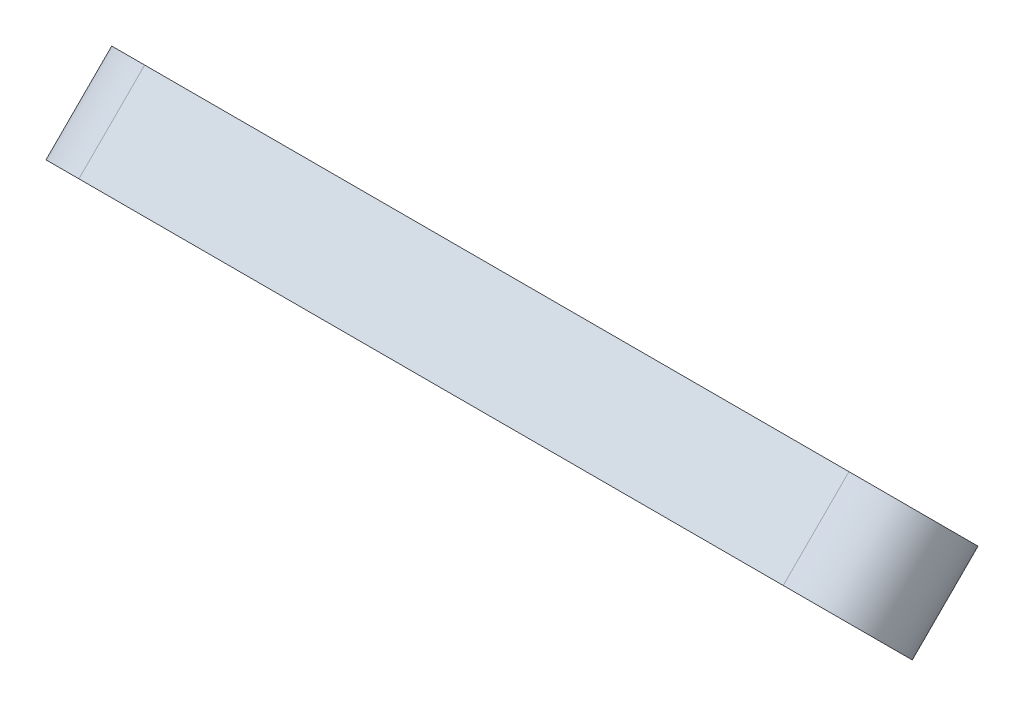
ISO-10303-21;
HEADER;
FILE_DESCRIPTION(('STEP AP214'),'2;1');
FILE_NAME('part.step','',(''),(''),'','','');
FILE_SCHEMA(('AUTOMOTIVE_DESIGN { 1 0 10303 214 1 1 1 1 }'));
ENDSEC;
DATA;
#1=APPLICATION_CONTEXT('core data for automotive mechanical design processes');
#2=APPLICATION_PROTOCOL_DEFINITION('international standard','automotive_design',2000,#1);
#3=PRODUCT_CONTEXT('',#1,'mechanical');
#4=PRODUCT('Part','Part','',(#3));
#5=PRODUCT_RELATED_PRODUCT_CATEGORY('part','',(#4));
#6=PRODUCT_DEFINITION_FORMATION('','',#4);
#7=PRODUCT_DEFINITION_CONTEXT('part definition',#1,'design');
#8=PRODUCT_DEFINITION('design','',#6,#7);
#9=PRODUCT_DEFINITION_SHAPE('','',#8);
#10=(LENGTH_UNIT() NAMED_UNIT(*) SI_UNIT(.MILLI.,.METRE.));
#11=(NAMED_UNIT(*) PLANE_ANGLE_UNIT() SI_UNIT($,.RADIAN.));
#12=(NAMED_UNIT(*) SI_UNIT($,.STERADIAN.) SOLID_ANGLE_UNIT());
#13=UNCERTAINTY_MEASURE_WITH_UNIT(LENGTH_MEASURE(1.E-05),#10,'distance_accuracy_value','');
#14=(GEOMETRIC_REPRESENTATION_CONTEXT(3) GLOBAL_UNCERTAINTY_ASSIGNED_CONTEXT((#13)) GLOBAL_UNIT_ASSIGNED_CONTEXT((#10,
#11,#12)) REPRESENTATION_CONTEXT('',''));
#15=CARTESIAN_POINT('',(0.,0.,0.));
#16=DIRECTION('',(0.,0.,1.));
#17=DIRECTION('',(1.,0.,0.));
#18=AXIS2_PLACEMENT_3D('',#15,#16,#17);
#19=CARTESIAN_POINT('',(134.383610490779,407.620315845602,313.814874477006));
#20=DIRECTION('',(0.,0.707106781186543,-0.707106781186552));
#21=DIRECTION('',(0.,0.707106781186552,0.707106781186543));
#22=AXIS2_PLACEMENT_3D('',#19,#20,#21);
#23=PLANE('',#22);
#24=CARTESIAN_POINT('',(60.190210490781,406.5986662742,312.793224905606));
#25=DIRECTION('',(0.,0.707106781186543,-0.707106781186552));
#26=DIRECTION('',(0.,0.707106781186552,0.707106781186543));
#27=AXIS2_PLACEMENT_3D('',#24,#25,#26);
#28=CIRCLE('',#27,2.28600000000289);
#29=CARTESIAN_POINT('',(60.190210490781,408.215112375994,314.4096710074));
#30=VERTEX_POINT('',#29);
#31=EDGE_CURVE('E121',#30,#30,#28,.T.);
#32=ORIENTED_EDGE('',*,*,#31,.F.);
#33=EDGE_LOOP('',(#32));
#34=FACE_BOUND('',#33,.T.);
#35=CARTESIAN_POINT('',(134.383610490779,407.620315845602,313.814874477006));
#36=DIRECTION('',(0.,0.707106781186543,-0.707106781186552));
#37=DIRECTION('',(0.,0.707106781186552,0.707106781186543));
#38=AXIS2_PLACEMENT_3D('',#35,#36,#37);
#39=CIRCLE('',#38,2.31139999999997);
#40=CARTESIAN_POINT('',(134.383610490779,409.254722459636,315.449281091041));
#41=VERTEX_POINT('',#40);
#42=EDGE_CURVE('E100',#41,#41,#39,.T.);
#43=ORIENTED_EDGE('',*,*,#42,.F.);
#44=EDGE_LOOP('',(#43));
#45=FACE_BOUND('',#44,.T.);
#46=CARTESIAN_POINT('',(134.383610490779,407.620315845602,313.814874477006));
#47=DIRECTION('',(0.,0.707106781186543,-0.707106781186552));
#48=DIRECTION('',(0.,0.707106781186552,0.707106781186543));
#49=AXIS2_PLACEMENT_3D('',#46,#47,#48);
#50=CIRCLE('',#49,9.03858422890067);
#51=CARTESIAN_POINT('',(134.207627879496,414.010348513103,320.204907144507));
#52=VERTEX_POINT('',#51);
#53=CARTESIAN_POINT('',(134.559593102062,401.230283178101,307.424841809505));
#54=VERTEX_POINT('',#53);
#55=EDGE_CURVE('E85',#52,#54,#50,.T.);
#56=ORIENTED_EDGE('',*,*,#55,.T.);
#57=DIRECTION('',(-0.999810438618444,-0.0137674767040955,-0.0137674767040756));
#58=VECTOR('',#57,1.);
#59=CARTESIAN_POINT('',(134.559593102062,401.230283178101,307.424841809505));
#60=LINE('',#59,#58);
#61=CARTESIAN_POINT('',(36.9727931020665,399.886504453923,306.081063085329));
#62=VERTEX_POINT('',#61);
#63=EDGE_CURVE('E80',#54,#62,#60,.T.);
#64=ORIENTED_EDGE('',*,*,#63,.T.);
#65=CARTESIAN_POINT('',(36.7968104907783,406.276537121425,312.471095752831));
#66=DIRECTION('',(0.,0.707106781186543,-0.707106781186552));
#67=DIRECTION('',(0.,0.707106781186552,0.707106781186543));
#68=AXIS2_PLACEMENT_3D('',#65,#66,#67);
#69=CIRCLE('',#68,9.03858422890192);
#70=CARTESIAN_POINT('',(36.6208278794964,412.666569788926,318.861128420332));
#71=VERTEX_POINT('',#70);
#72=EDGE_CURVE('E83',#62,#71,#69,.T.);
#73=ORIENTED_EDGE('',*,*,#72,.T.);
#74=DIRECTION('',(0.999810438618444,0.0137674767040773,0.0137674767040574));
#75=VECTOR('',#74,1.);
#76=CARTESIAN_POINT('',(134.207627879496,414.010348513103,320.204907144507));
#77=LINE('',#76,#75);
#78=EDGE_CURVE('E50',#71,#52,#77,.T.);
#79=ORIENTED_EDGE('',*,*,#78,.T.);
#80=EDGE_LOOP('',(#56,#64,#73,#79));
#81=FACE_BOUND('',#80,.T.);
#82=CARTESIAN_POINT('',(36.7968104907783,406.276537121425,312.471095752831));
#83=DIRECTION('',(0.,0.707106781186543,-0.707106781186552));
#84=DIRECTION('',(0.,0.707106781186552,0.707106781186543));
#85=AXIS2_PLACEMENT_3D('',#82,#83,#84);
#86=CIRCLE('',#85,2.31140000000004);
#87=CARTESIAN_POINT('',(36.7968104907783,407.910943735459,314.105502366866));
#88=VERTEX_POINT('',#87);
#89=EDGE_CURVE('E115',#88,#88,#86,.T.);
#90=ORIENTED_EDGE('',*,*,#89,.F.);
#91=EDGE_LOOP('',(#90));
#92=FACE_BOUND('',#91,.T.);
#93=CARTESIAN_POINT('',(110.990210490781,407.298186692825,313.49274532423));
#94=DIRECTION('',(0.,0.707106781186543,-0.707106781186552));
#95=DIRECTION('',(0.,0.707106781186552,0.707106781186543));
#96=AXIS2_PLACEMENT_3D('',#93,#94,#95);
#97=CIRCLE('',#96,2.2860000000025);
#98=CARTESIAN_POINT('',(110.990210490781,408.914632794619,315.109191426024));
#99=VERTEX_POINT('',#98);
#100=EDGE_CURVE('E127',#99,#99,#97,.T.);
#101=ORIENTED_EDGE('',*,*,#100,.F.);
#102=EDGE_LOOP('',(#101));
#103=FACE_BOUND('',#102,.T.);
#104=ADVANCED_FACE('F33',(#34,#45,#81,#92,#103),#23,.T.);
#105=CARTESIAN_POINT('',(134.383610490779,398.640059724532,322.795130598075));
#106=DIRECTION('',(0.,0.707106781186543,-0.707106781186552));
#107=DIRECTION('',(0.,0.707106781186552,0.707106781186543));
#108=AXIS2_PLACEMENT_3D('',#105,#106,#107);
#109=PLANE('',#108);
#110=CARTESIAN_POINT('',(134.383610490779,398.640059724532,322.795130598075));
#111=DIRECTION('',(0.,0.707106781186543,-0.707106781186552));
#112=DIRECTION('',(0.,0.707106781186552,0.707106781186543));
#113=AXIS2_PLACEMENT_3D('',#110,#111,#112);
#114=CIRCLE('',#113,9.03858422890067);
#115=CARTESIAN_POINT('',(134.207627879496,405.030092392033,329.185163265576));
#116=VERTEX_POINT('',#115);
#117=CARTESIAN_POINT('',(134.559593102062,392.250027057032,316.405097930574));
#118=VERTEX_POINT('',#117);
#119=EDGE_CURVE('E97',#116,#118,#114,.T.);
#120=ORIENTED_EDGE('',*,*,#119,.F.);
#121=DIRECTION('',(0.999810438618444,0.0137674767040773,0.0137674767040574));
#122=VECTOR('',#121,1.);
#123=CARTESIAN_POINT('',(134.207627879496,405.030092392033,329.185163265576));
#124=LINE('',#123,#122);
#125=CARTESIAN_POINT('',(36.6208278794966,403.686313667857,327.841384541401));
#126=VERTEX_POINT('',#125);
#127=EDGE_CURVE('E73',#126,#116,#124,.T.);
#128=ORIENTED_EDGE('',*,*,#127,.F.);
#129=CARTESIAN_POINT('',(36.7968104907785,397.296281000356,321.4513518739));
#130=DIRECTION('',(0.,0.707106781186543,-0.707106781186552));
#131=DIRECTION('',(0.,0.707106781186552,0.707106781186543));
#132=AXIS2_PLACEMENT_3D('',#129,#130,#131);
#133=CIRCLE('',#132,9.03858422890192);
#134=CARTESIAN_POINT('',(36.9727931020667,390.906248332854,315.061319206399));
#135=VERTEX_POINT('',#134);
#136=EDGE_CURVE('E67',#135,#126,#133,.T.);
#137=ORIENTED_EDGE('',*,*,#136,.F.);
#138=DIRECTION('',(-0.999810438618444,-0.0137674767040955,-0.0137674767040756));
#139=VECTOR('',#138,1.);
#140=CARTESIAN_POINT('',(134.559593102062,392.250027057032,316.405097930574));
#141=LINE('',#140,#139);
#142=EDGE_CURVE('E89',#118,#135,#141,.T.);
#143=ORIENTED_EDGE('',*,*,#142,.F.);
#144=EDGE_LOOP('',(#120,#128,#137,#143));
#145=FACE_BOUND('',#144,.T.);
#146=CARTESIAN_POINT('',(134.383610490779,398.640059724532,322.795130598075));
#147=DIRECTION('',(0.,0.707106781186543,-0.707106781186552));
#148=DIRECTION('',(0.,0.707106781186552,0.707106781186543));
#149=AXIS2_PLACEMENT_3D('',#146,#147,#148);
#150=CIRCLE('',#149,2.31139999999997);
#151=CARTESIAN_POINT('',(134.383610490779,400.274466338567,324.42953721211));
#152=VERTEX_POINT('',#151);
#153=EDGE_CURVE('E112',#152,#152,#150,.T.);
#154=ORIENTED_EDGE('',*,*,#153,.T.);
#155=EDGE_LOOP('',(#154));
#156=FACE_BOUND('',#155,.T.);
#157=CARTESIAN_POINT('',(36.7968104907785,397.296281000356,321.4513518739));
#158=DIRECTION('',(0.,0.707106781186543,-0.707106781186552));
#159=DIRECTION('',(0.,0.707106781186552,0.707106781186543));
#160=AXIS2_PLACEMENT_3D('',#157,#158,#159);
#161=CIRCLE('',#160,2.31140000000004);
#162=CARTESIAN_POINT('',(36.7968104907785,398.93068761439,323.085758487935));
#163=VERTEX_POINT('',#162);
#164=EDGE_CURVE('E118',#163,#163,#161,.T.);
#165=ORIENTED_EDGE('',*,*,#164,.T.);
#166=EDGE_LOOP('',(#165));
#167=FACE_BOUND('',#166,.T.);
#168=CARTESIAN_POINT('',(60.1902104907812,397.618410153131,321.773481026675));
#169=DIRECTION('',(0.,0.707106781186543,-0.707106781186552));
#170=DIRECTION('',(0.,0.707106781186552,0.707106781186543));
#171=AXIS2_PLACEMENT_3D('',#168,#169,#170);
#172=CIRCLE('',#171,2.28600000000289);
#173=CARTESIAN_POINT('',(60.1902104907812,399.234856254925,323.389927128469));
#174=VERTEX_POINT('',#173);
#175=EDGE_CURVE('E124',#174,#174,#172,.T.);
#176=ORIENTED_EDGE('',*,*,#175,.T.);
#177=EDGE_LOOP('',(#176));
#178=FACE_BOUND('',#177,.T.);
#179=CARTESIAN_POINT('',(110.990210490781,398.317930571756,322.473001445299));
#180=DIRECTION('',(0.,0.707106781186543,-0.707106781186552));
#181=DIRECTION('',(0.,0.707106781186552,0.707106781186543));
#182=AXIS2_PLACEMENT_3D('',#179,#180,#181);
#183=CIRCLE('',#182,2.2860000000025);
#184=CARTESIAN_POINT('',(110.990210490781,399.93437667355,324.089447547093));
#185=VERTEX_POINT('',#184);
#186=EDGE_CURVE('E130',#185,#185,#183,.T.);
#187=ORIENTED_EDGE('',*,*,#186,.T.);
#188=EDGE_LOOP('',(#187));
#189=FACE_BOUND('',#188,.T.);
#190=ADVANCED_FACE('F108',(#145,#156,#167,#178,#189),#109,.F.);
#191=CARTESIAN_POINT('',(134.383610490779,407.620315845602,313.814874477006));
#192=DIRECTION('',(0.,-0.707106781186543,0.707106781186552));
#193=DIRECTION('',(0.,-0.707106781186552,-0.707106781186543));
#194=AXIS2_PLACEMENT_3D('',#191,#192,#193);
#195=CYLINDRICAL_SURFACE('',#194,9.03858422890067);
#196=ORIENTED_EDGE('',*,*,#119,.T.);
#197=DIRECTION('',(0.,-0.707106781186543,0.707106781186552));
#198=VECTOR('',#197,1.);
#199=CARTESIAN_POINT('',(134.559593102062,401.230283178101,307.424841809505));
#200=LINE('',#199,#198);
#201=EDGE_CURVE('E11',#54,#118,#200,.T.);
#202=ORIENTED_EDGE('',*,*,#201,.F.);
#203=ORIENTED_EDGE('',*,*,#55,.F.);
#204=DIRECTION('',(0.,-0.707106781186543,0.707106781186552));
#205=VECTOR('',#204,1.);
#206=CARTESIAN_POINT('',(134.207627879496,414.010348513103,320.204907144507));
#207=LINE('',#206,#205);
#208=EDGE_CURVE('E93',#52,#116,#207,.T.);
#209=ORIENTED_EDGE('',*,*,#208,.T.);
#210=EDGE_LOOP('',(#196,#202,#203,#209));
#211=FACE_BOUND('',#210,.T.);
#212=ADVANCED_FACE('F35',(#211),#195,.T.);
#213=CARTESIAN_POINT('',(134.559593102062,401.230283178101,307.424841809505));
#214=DIRECTION('',(-0.0194701522745734,0.706972741048203,0.706972741048194));
#215=DIRECTION('',(0.,-0.707106781186543,0.707106781186552));
#216=AXIS2_PLACEMENT_3D('',#213,#214,#215);
#217=PLANE('',#216);
#218=ORIENTED_EDGE('',*,*,#142,.T.);
#219=DIRECTION('',(0.,-0.707106781186543,0.707106781186552));
#220=VECTOR('',#219,1.);
#221=CARTESIAN_POINT('',(36.9727931020665,399.886504453923,306.081063085329));
#222=LINE('',#221,#220);
#223=EDGE_CURVE('E42',#62,#135,#222,.T.);
#224=ORIENTED_EDGE('',*,*,#223,.F.);
#225=ORIENTED_EDGE('',*,*,#63,.F.);
#226=ORIENTED_EDGE('',*,*,#201,.T.);
#227=EDGE_LOOP('',(#218,#224,#225,#226));
#228=FACE_BOUND('',#227,.T.);
#229=ADVANCED_FACE('F88',(#228),#217,.F.);
#230=CARTESIAN_POINT('',(36.7968104907783,406.276537121425,312.471095752831));
#231=DIRECTION('',(0.,-0.707106781186543,0.707106781186552));
#232=DIRECTION('',(0.,-0.707106781186552,-0.707106781186543));
#233=AXIS2_PLACEMENT_3D('',#230,#231,#232);
#234=CYLINDRICAL_SURFACE('',#233,9.03858422890192);
#235=ORIENTED_EDGE('',*,*,#136,.T.);
#236=DIRECTION('',(0.,-0.707106781186543,0.707106781186552));
#237=VECTOR('',#236,1.);
#238=CARTESIAN_POINT('',(36.6208278794964,412.666569788926,318.861128420332));
#239=LINE('',#238,#237);
#240=EDGE_CURVE('E90',#71,#126,#239,.T.);
#241=ORIENTED_EDGE('',*,*,#240,.F.);
#242=ORIENTED_EDGE('',*,*,#72,.F.);
#243=ORIENTED_EDGE('',*,*,#223,.T.);
#244=EDGE_LOOP('',(#235,#241,#242,#243));
#245=FACE_BOUND('',#244,.T.);
#246=ADVANCED_FACE('F91',(#245),#234,.T.);
#247=CARTESIAN_POINT('',(134.207627879496,414.010348513103,320.204907144507));
#248=DIRECTION('',(0.0194701522745477,-0.706972741048203,-0.706972741048194));
#249=DIRECTION('',(0.,0.707106781186543,-0.707106781186552));
#250=AXIS2_PLACEMENT_3D('',#247,#248,#249);
#251=PLANE('',#250);
#252=ORIENTED_EDGE('',*,*,#127,.T.);
#253=ORIENTED_EDGE('',*,*,#208,.F.);
#254=ORIENTED_EDGE('',*,*,#78,.F.);
#255=ORIENTED_EDGE('',*,*,#240,.T.);
#256=EDGE_LOOP('',(#252,#253,#254,#255));
#257=FACE_BOUND('',#256,.T.);
#258=ADVANCED_FACE('F105',(#257),#251,.F.);
#259=CARTESIAN_POINT('',(134.383610490779,407.620315845602,313.814874477006));
#260=DIRECTION('',(0.,-0.707106781186543,0.707106781186552));
#261=DIRECTION('',(0.,-0.707106781186552,-0.707106781186543));
#262=AXIS2_PLACEMENT_3D('',#259,#260,#261);
#263=CYLINDRICAL_SURFACE('',#262,2.31139999999997);
#264=ORIENTED_EDGE('',*,*,#42,.T.);
#265=EDGE_LOOP('',(#264));
#266=FACE_BOUND('',#265,.T.);
#267=ORIENTED_EDGE('',*,*,#153,.F.);
#268=EDGE_LOOP('',(#267));
#269=FACE_BOUND('',#268,.T.);
#270=ADVANCED_FACE('F149',(#266,#269),#263,.F.);
#271=CARTESIAN_POINT('',(36.7968104907783,406.276537121425,312.471095752831));
#272=DIRECTION('',(0.,-0.707106781186543,0.707106781186552));
#273=DIRECTION('',(0.,-0.707106781186552,-0.707106781186543));
#274=AXIS2_PLACEMENT_3D('',#271,#272,#273);
#275=CYLINDRICAL_SURFACE('',#274,2.31140000000004);
#276=ORIENTED_EDGE('',*,*,#89,.T.);
#277=EDGE_LOOP('',(#276));
#278=FACE_BOUND('',#277,.T.);
#279=ORIENTED_EDGE('',*,*,#164,.F.);
#280=EDGE_LOOP('',(#279));
#281=FACE_BOUND('',#280,.T.);
#282=ADVANCED_FACE('F195',(#278,#281),#275,.F.);
#283=CARTESIAN_POINT('',(60.190210490781,406.5986662742,312.793224905606));
#284=DIRECTION('',(0.,-0.707106781186543,0.707106781186552));
#285=DIRECTION('',(0.,-0.707106781186552,-0.707106781186543));
#286=AXIS2_PLACEMENT_3D('',#283,#284,#285);
#287=CYLINDRICAL_SURFACE('',#286,2.28600000000289);
#288=ORIENTED_EDGE('',*,*,#31,.T.);
#289=EDGE_LOOP('',(#288));
#290=FACE_BOUND('',#289,.T.);
#291=ORIENTED_EDGE('',*,*,#175,.F.);
#292=EDGE_LOOP('',(#291));
#293=FACE_BOUND('',#292,.T.);
#294=ADVANCED_FACE('F203',(#290,#293),#287,.F.);
#295=CARTESIAN_POINT('',(110.990210490781,407.298186692825,313.49274532423));
#296=DIRECTION('',(0.,-0.707106781186543,0.707106781186552));
#297=DIRECTION('',(0.,-0.707106781186552,-0.707106781186543));
#298=AXIS2_PLACEMENT_3D('',#295,#296,#297);
#299=CYLINDRICAL_SURFACE('',#298,2.2860000000025);
#300=ORIENTED_EDGE('',*,*,#100,.T.);
#301=EDGE_LOOP('',(#300));
#302=FACE_BOUND('',#301,.T.);
#303=ORIENTED_EDGE('',*,*,#186,.F.);
#304=EDGE_LOOP('',(#303));
#305=FACE_BOUND('',#304,.T.);
#306=ADVANCED_FACE('F136',(#302,#305),#299,.F.);
#307=CLOSED_SHELL('',(#104,#190,#212,#229,#246,#258,#270,#282,#294,#306));
#308=MANIFOLD_SOLID_BREP('B2',#307);
#309=ADVANCED_BREP_SHAPE_REPRESENTATION('',(#18,#308),#14);
#310=SHAPE_DEFINITION_REPRESENTATION(#9,#309);
ENDSEC;
END-ISO-10303-21;
